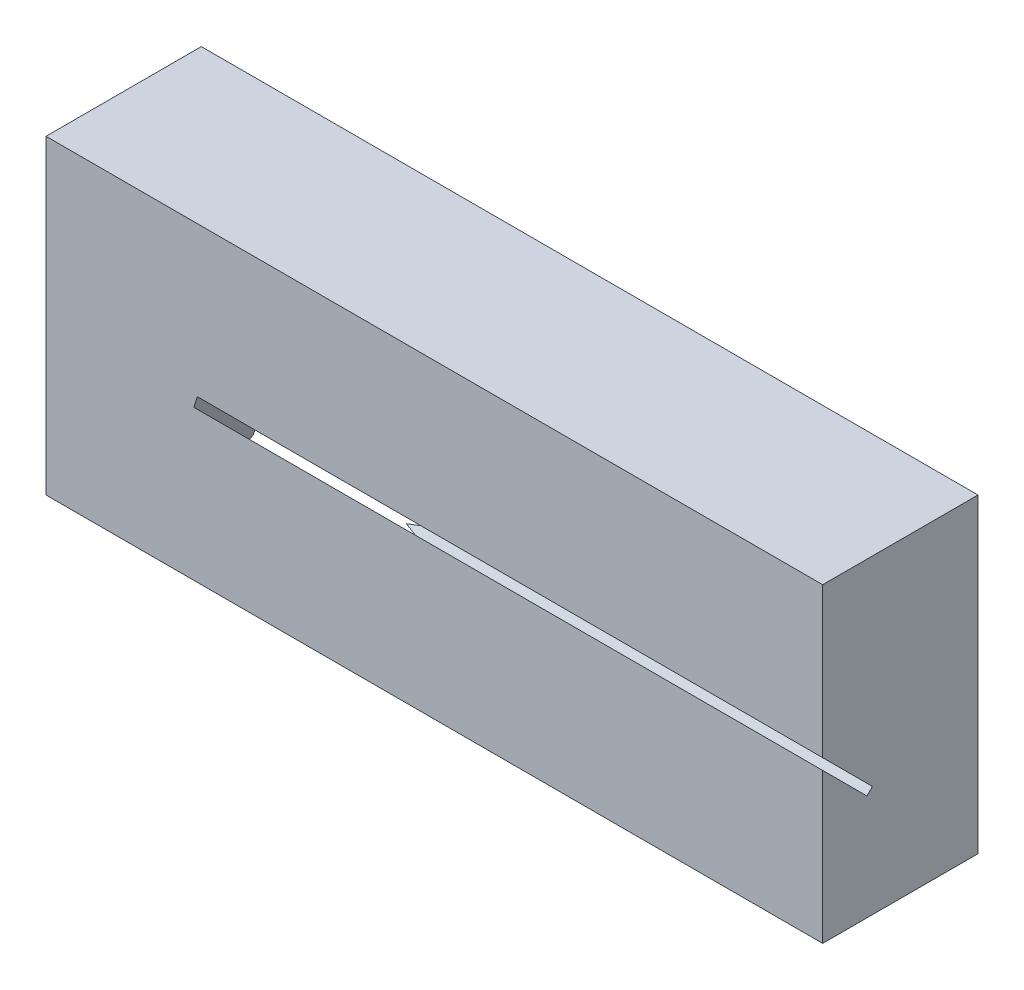
ISO-10303-21;
HEADER;
FILE_DESCRIPTION(('STEP AP214'),'2;1');
FILE_NAME('part.step','',(''),(''),'','','');
FILE_SCHEMA(('AUTOMOTIVE_DESIGN { 1 0 10303 214 1 1 1 1 }'));
ENDSEC;
DATA;
#1=APPLICATION_CONTEXT('core data for automotive mechanical design processes');
#2=APPLICATION_PROTOCOL_DEFINITION('international standard','automotive_design',2000,#1);
#3=PRODUCT_CONTEXT('',#1,'mechanical');
#4=PRODUCT('Part','Part','',(#3));
#5=PRODUCT_RELATED_PRODUCT_CATEGORY('part','',(#4));
#6=PRODUCT_DEFINITION_FORMATION('','',#4);
#7=PRODUCT_DEFINITION_CONTEXT('part definition',#1,'design');
#8=PRODUCT_DEFINITION('design','',#6,#7);
#9=PRODUCT_DEFINITION_SHAPE('','',#8);
#10=(LENGTH_UNIT() NAMED_UNIT(*) SI_UNIT(.MILLI.,.METRE.));
#11=(NAMED_UNIT(*) PLANE_ANGLE_UNIT() SI_UNIT($,.RADIAN.));
#12=(NAMED_UNIT(*) SI_UNIT($,.STERADIAN.) SOLID_ANGLE_UNIT());
#13=UNCERTAINTY_MEASURE_WITH_UNIT(LENGTH_MEASURE(1.E-05),#10,'distance_accuracy_value','');
#14=(GEOMETRIC_REPRESENTATION_CONTEXT(3) GLOBAL_UNCERTAINTY_ASSIGNED_CONTEXT((#13)) GLOBAL_UNIT_ASSIGNED_CONTEXT((#10,
#11,#12)) REPRESENTATION_CONTEXT('',''));
#15=CARTESIAN_POINT('',(0.,0.,0.));
#16=DIRECTION('',(0.,0.,1.));
#17=DIRECTION('',(1.,0.,0.));
#18=AXIS2_PLACEMENT_3D('',#15,#16,#17);
#19=CARTESIAN_POINT('',(25.,10.,10.));
#20=DIRECTION('',(-1.,0.,0.));
#21=DIRECTION('',(0.,-1.,0.));
#22=AXIS2_PLACEMENT_3D('',#19,#20,#21);
#23=PLANE('',#22);
#24=DIRECTION('',(0.,0.707106781186549,0.707106781186546));
#25=VECTOR('',#24,1.);
#26=CARTESIAN_POINT('',(25.,5.17677669529667,14.8232233047033));
#27=LINE('',#26,#25);
#28=CARTESIAN_POINT('',(25.,-2.85004648115068,6.79640012825603));
#29=VERTEX_POINT('',#28);
#30=CARTESIAN_POINT('',(25.,0.353553390593306,10.));
#31=VERTEX_POINT('',#30);
#32=EDGE_CURVE('E110',#29,#31,#27,.T.);
#33=ORIENTED_EDGE('',*,*,#32,.F.);
#34=DIRECTION('',(0.,-0.707106781186546,0.707106781186549));
#35=VECTOR('',#34,1.);
#36=CARTESIAN_POINT('',(25.,1.97317682355265,1.97317682355268));
#37=LINE('',#36,#35);
#38=CARTESIAN_POINT('',(25.,-3.20359987174395,7.1499535188493));
#39=VERTEX_POINT('',#38);
#40=EDGE_CURVE('E133',#29,#39,#37,.T.);
#41=ORIENTED_EDGE('',*,*,#40,.T.);
#42=DIRECTION('',(0.,0.707106781186549,0.707106781186546));
#43=VECTOR('',#42,1.);
#44=CARTESIAN_POINT('',(25.,4.8232233047034,15.1767766952966));
#45=LINE('',#44,#43);
#46=CARTESIAN_POINT('',(25.,-0.353553390593243,10.));
#47=VERTEX_POINT('',#46);
#48=EDGE_CURVE('E126',#39,#47,#45,.T.);
#49=ORIENTED_EDGE('',*,*,#48,.T.);
#50=DIRECTION('',(0.,1.,0.));
#51=VECTOR('',#50,1.);
#52=CARTESIAN_POINT('',(25.,10.,10.));
#53=LINE('',#52,#51);
#54=CARTESIAN_POINT('',(25.,-10.,10.));
#55=VERTEX_POINT('',#54);
#56=EDGE_CURVE('E140',#55,#47,#53,.T.);
#57=ORIENTED_EDGE('',*,*,#56,.F.);
#58=DIRECTION('',(0.,0.,-1.));
#59=VECTOR('',#58,1.);
#60=CARTESIAN_POINT('',(25.,-10.,10.));
#61=LINE('',#60,#59);
#62=CARTESIAN_POINT('',(25.,-10.,0.));
#63=VERTEX_POINT('',#62);
#64=EDGE_CURVE('E149',#55,#63,#61,.T.);
#65=ORIENTED_EDGE('',*,*,#64,.T.);
#66=DIRECTION('',(0.,1.,0.));
#67=VECTOR('',#66,1.);
#68=CARTESIAN_POINT('',(25.,10.,0.));
#69=LINE('',#68,#67);
#70=CARTESIAN_POINT('',(25.,10.,0.));
#71=VERTEX_POINT('',#70);
#72=EDGE_CURVE('E139',#63,#71,#69,.T.);
#73=ORIENTED_EDGE('',*,*,#72,.T.);
#74=DIRECTION('',(0.,0.,-1.));
#75=VECTOR('',#74,1.);
#76=CARTESIAN_POINT('',(25.,10.,10.));
#77=LINE('',#76,#75);
#78=CARTESIAN_POINT('',(25.,10.,10.));
#79=VERTEX_POINT('',#78);
#80=EDGE_CURVE('E168',#79,#71,#77,.T.);
#81=ORIENTED_EDGE('',*,*,#80,.F.);
#82=EDGE_CURVE('E143',#31,#79,#53,.T.);
#83=ORIENTED_EDGE('',*,*,#82,.F.);
#84=EDGE_LOOP('',(#33,#41,#49,#57,#65,#73,#81,#83));
#85=FACE_BOUND('',#84,.T.);
#86=ADVANCED_FACE('F33',(#85),#23,.F.);
#87=CARTESIAN_POINT('',(0.,0.,10.));
#88=DIRECTION('',(0.,0.,1.));
#89=DIRECTION('',(1.,0.,0.));
#90=AXIS2_PLACEMENT_3D('',#87,#88,#89);
#91=PLANE('',#90);
#92=DIRECTION('',(-0.300294039609494,-0.953846680434026,0.));
#93=VECTOR('',#92,1.);
#94=CARTESIAN_POINT('',(-13.9820122594664,4.40187613941699,10.));
#95=LINE('',#94,#93);
#96=CARTESIAN_POINT('',(-15.2565223215386,0.353553390593307,10.));
#97=VERTEX_POINT('',#96);
#98=CARTESIAN_POINT('',(-15.4791366641928,-0.353553390593244,10.));
#99=VERTEX_POINT('',#98);
#100=EDGE_CURVE('E118',#97,#99,#95,.T.);
#101=ORIENTED_EDGE('',*,*,#100,.F.);
#102=DIRECTION('',(1.,0.,0.));
#103=VECTOR('',#102,1.);
#104=CARTESIAN_POINT('',(0.,0.353553390593307,10.));
#105=LINE('',#104,#103);
#106=EDGE_CURVE('E106',#97,#31,#105,.T.);
#107=ORIENTED_EDGE('',*,*,#106,.T.);
#108=ORIENTED_EDGE('',*,*,#82,.T.);
#109=DIRECTION('',(-1.,0.,0.));
#110=VECTOR('',#109,1.);
#111=CARTESIAN_POINT('',(-25.,10.,10.));
#112=LINE('',#111,#110);
#113=CARTESIAN_POINT('',(-25.,10.,10.));
#114=VERTEX_POINT('',#113);
#115=EDGE_CURVE('E142',#79,#114,#112,.T.);
#116=ORIENTED_EDGE('',*,*,#115,.T.);
#117=DIRECTION('',(0.,-1.,0.));
#118=VECTOR('',#117,1.);
#119=CARTESIAN_POINT('',(-25.,10.,10.));
#120=LINE('',#119,#118);
#121=CARTESIAN_POINT('',(-25.,-10.,10.));
#122=VERTEX_POINT('',#121);
#123=EDGE_CURVE('E145',#114,#122,#120,.T.);
#124=ORIENTED_EDGE('',*,*,#123,.T.);
#125=DIRECTION('',(1.,0.,0.));
#126=VECTOR('',#125,1.);
#127=CARTESIAN_POINT('',(-25.,-10.,10.));
#128=LINE('',#127,#126);
#129=EDGE_CURVE('E147',#122,#55,#128,.T.);
#130=ORIENTED_EDGE('',*,*,#129,.T.);
#131=ORIENTED_EDGE('',*,*,#56,.T.);
#132=DIRECTION('',(1.,0.,0.));
#133=VECTOR('',#132,1.);
#134=CARTESIAN_POINT('',(0.,-0.353553390593243,10.));
#135=LINE('',#134,#133);
#136=EDGE_CURVE('E11',#99,#47,#135,.T.);
#137=ORIENTED_EDGE('',*,*,#136,.F.);
#138=EDGE_LOOP('',(#101,#107,#108,#116,#124,#130,#131,#137));
#139=FACE_BOUND('',#138,.T.);
#140=ADVANCED_FACE('F124',(#139),#91,.T.);
#141=CARTESIAN_POINT('',(-25.,10.,10.));
#142=DIRECTION('',(0.,-1.,0.));
#143=DIRECTION('',(0.,0.,-1.));
#144=AXIS2_PLACEMENT_3D('',#141,#142,#143);
#145=PLANE('',#144);
#146=DIRECTION('',(-1.,0.,0.));
#147=VECTOR('',#146,1.);
#148=CARTESIAN_POINT('',(-25.,10.,0.));
#149=LINE('',#148,#147);
#150=CARTESIAN_POINT('',(-25.,10.,0.));
#151=VERTEX_POINT('',#150);
#152=EDGE_CURVE('E152',#71,#151,#149,.T.);
#153=ORIENTED_EDGE('',*,*,#152,.T.);
#154=DIRECTION('',(0.,0.,-1.));
#155=VECTOR('',#154,1.);
#156=CARTESIAN_POINT('',(-25.,10.,10.));
#157=LINE('',#156,#155);
#158=EDGE_CURVE('E165',#114,#151,#157,.T.);
#159=ORIENTED_EDGE('',*,*,#158,.F.);
#160=ORIENTED_EDGE('',*,*,#115,.F.);
#161=ORIENTED_EDGE('',*,*,#80,.T.);
#162=EDGE_LOOP('',(#153,#159,#160,#161));
#163=FACE_BOUND('',#162,.T.);
#164=ADVANCED_FACE('F193',(#163),#145,.F.);
#165=CARTESIAN_POINT('',(-25.,10.,10.));
#166=DIRECTION('',(1.,0.,0.));
#167=DIRECTION('',(0.,1.,0.));
#168=AXIS2_PLACEMENT_3D('',#165,#166,#167);
#169=PLANE('',#168);
#170=DIRECTION('',(0.,-1.,0.));
#171=VECTOR('',#170,1.);
#172=CARTESIAN_POINT('',(-25.,10.,0.));
#173=LINE('',#172,#171);
#174=CARTESIAN_POINT('',(-25.,-10.,0.));
#175=VERTEX_POINT('',#174);
#176=EDGE_CURVE('E154',#151,#175,#173,.T.);
#177=ORIENTED_EDGE('',*,*,#176,.T.);
#178=DIRECTION('',(0.,0.,-1.));
#179=VECTOR('',#178,1.);
#180=CARTESIAN_POINT('',(-25.,-10.,10.));
#181=LINE('',#180,#179);
#182=EDGE_CURVE('E162',#122,#175,#181,.T.);
#183=ORIENTED_EDGE('',*,*,#182,.F.);
#184=ORIENTED_EDGE('',*,*,#123,.F.);
#185=ORIENTED_EDGE('',*,*,#158,.T.);
#186=EDGE_LOOP('',(#177,#183,#184,#185));
#187=FACE_BOUND('',#186,.T.);
#188=ADVANCED_FACE('F186',(#187),#169,.F.);
#189=CARTESIAN_POINT('',(-25.,-10.,10.));
#190=DIRECTION('',(0.,1.,0.));
#191=DIRECTION('',(0.,0.,1.));
#192=AXIS2_PLACEMENT_3D('',#189,#190,#191);
#193=PLANE('',#192);
#194=DIRECTION('',(1.,0.,0.));
#195=VECTOR('',#194,1.);
#196=CARTESIAN_POINT('',(-25.,-10.,0.));
#197=LINE('',#196,#195);
#198=CARTESIAN_POINT('',(-21.6643139440744,-10.,0.));
#199=VERTEX_POINT('',#198);
#200=EDGE_CURVE('E157',#175,#199,#197,.T.);
#201=ORIENTED_EDGE('',*,*,#200,.T.);
#202=DIRECTION('',(0.300294039609493,0.,0.953846680434027));
#203=VECTOR('',#202,1.);
#204=CARTESIAN_POINT('',(-19.1007697434475,-10.,8.14277942077588));
#205=LINE('',#204,#203);
#206=CARTESIAN_POINT('',(-21.5530067727473,-10.,0.353553390593277));
#207=VERTEX_POINT('',#206);
#208=EDGE_CURVE('E127',#199,#207,#205,.T.);
#209=ORIENTED_EDGE('',*,*,#208,.T.);
#210=DIRECTION('',(1.,0.,0.));
#211=VECTOR('',#210,1.);
#212=CARTESIAN_POINT('',(-25.,-10.,0.353553390593278));
#213=LINE('',#212,#211);
#214=CARTESIAN_POINT('',(-10.8708348754012,-10.,0.353553390593278));
#215=VERTEX_POINT('',#214);
#216=EDGE_CURVE('E130',#207,#215,#213,.T.);
#217=ORIENTED_EDGE('',*,*,#216,.T.);
#218=DIRECTION('',(-0.935113126531029,0.,-0.354349320006917));
#219=VECTOR('',#218,1.);
#220=CARTESIAN_POINT('',(-20.0294786941052,-10.,-3.11699912039815));
#221=LINE('',#220,#219);
#222=CARTESIAN_POINT('',(-11.8038475772934,-10.,0.));
#223=VERTEX_POINT('',#222);
#224=EDGE_CURVE('E197',#215,#223,#221,.T.);
#225=ORIENTED_EDGE('',*,*,#224,.T.);
#226=EDGE_CURVE('E156',#223,#63,#197,.T.);
#227=ORIENTED_EDGE('',*,*,#226,.T.);
#228=ORIENTED_EDGE('',*,*,#64,.F.);
#229=ORIENTED_EDGE('',*,*,#129,.F.);
#230=ORIENTED_EDGE('',*,*,#182,.T.);
#231=EDGE_LOOP('',(#201,#209,#217,#225,#227,#228,#229,#230));
#232=FACE_BOUND('',#231,.T.);
#233=ADVANCED_FACE('F180',(#232),#193,.F.);
#234=CARTESIAN_POINT('',(0.,0.,0.));
#235=DIRECTION('',(0.,0.,1.));
#236=DIRECTION('',(1.,0.,0.));
#237=AXIS2_PLACEMENT_3D('',#234,#235,#236);
#238=PLANE('',#237);
#239=DIRECTION('',(1.,0.,0.));
#240=VECTOR('',#239,1.);
#241=CARTESIAN_POINT('',(0.,-9.64644660940673,0.));
#242=LINE('',#241,#240);
#243=CARTESIAN_POINT('',(-21.5530067727473,-9.64644660940673,0.));
#244=VERTEX_POINT('',#243);
#245=CARTESIAN_POINT('',(-10.8708348754012,-9.64644660940673,0.));
#246=VERTEX_POINT('',#245);
#247=EDGE_CURVE('E171',#244,#246,#242,.T.);
#248=ORIENTED_EDGE('',*,*,#247,.F.);
#249=DIRECTION('',(-0.300294039609494,-0.953846680434026,0.));
#250=VECTOR('',#249,1.);
#251=CARTESIAN_POINT('',(-16.8463569878228,5.30364124166687,0.));
#252=LINE('',#251,#250);
#253=EDGE_CURVE('E40',#244,#199,#252,.T.);
#254=ORIENTED_EDGE('',*,*,#253,.T.);
#255=ORIENTED_EDGE('',*,*,#200,.F.);
#256=ORIENTED_EDGE('',*,*,#176,.F.);
#257=ORIENTED_EDGE('',*,*,#152,.F.);
#258=ORIENTED_EDGE('',*,*,#72,.F.);
#259=ORIENTED_EDGE('',*,*,#226,.F.);
#260=DIRECTION('',(0.935113126531029,0.354349320006915,0.));
#261=VECTOR('',#260,1.);
#262=CARTESIAN_POINT('',(1.83143529116073,-4.83308160750287,0.));
#263=LINE('',#262,#261);
#264=EDGE_CURVE('E173',#223,#246,#263,.T.);
#265=ORIENTED_EDGE('',*,*,#264,.T.);
#266=EDGE_LOOP('',(#248,#254,#255,#256,#257,#258,#259,#265));
#267=FACE_BOUND('',#266,.T.);
#268=ADVANCED_FACE('F177',(#267),#238,.F.);
#269=CARTESIAN_POINT('',(0.,-5.17677669529662,5.17677669529664));
#270=DIRECTION('',(0.,-0.707106781186546,0.707106781186549));
#271=DIRECTION('',(0.,-0.707106781186549,-0.707106781186546));
#272=AXIS2_PLACEMENT_3D('',#269,#270,#271);
#273=PLANE('',#272);
#274=DIRECTION('',(-0.406736643075797,-0.645974188021253,-0.645974188021251));
#275=VECTOR('',#274,1.);
#276=CARTESIAN_POINT('',(-23.,-12.2980970388563,-1.944543648263));
#277=LINE('',#276,#275);
#278=EDGE_CURVE('E46',#99,#207,#277,.T.);
#279=ORIENTED_EDGE('',*,*,#278,.F.);
#280=ORIENTED_EDGE('',*,*,#136,.T.);
#281=ORIENTED_EDGE('',*,*,#48,.F.);
#282=DIRECTION('',(0.965925826289068,0.18301270189222,0.18301270189222));
#283=VECTOR('',#282,1.);
#284=CARTESIAN_POINT('',(-23.,-12.2980970388563,-1.944543648263));
#285=LINE('',#284,#283);
#286=EDGE_CURVE('E122',#215,#39,#285,.T.);
#287=ORIENTED_EDGE('',*,*,#286,.F.);
#288=ORIENTED_EDGE('',*,*,#216,.F.);
#289=EDGE_LOOP('',(#279,#280,#281,#287,#288));
#290=FACE_BOUND('',#289,.T.);
#291=ADVANCED_FACE('F209',(#290),#273,.F.);
#292=CARTESIAN_POINT('',(-23.,-11.944543648263,-2.29809703885628));
#293=DIRECTION('',(-0.913545457642602,0.287606238475949,0.287606238475948));
#294=DIRECTION('',(-0.300294039609494,-0.953846680434026,0.));
#295=AXIS2_PLACEMENT_3D('',#292,#293,#294);
#296=PLANE('',#295);
#297=ORIENTED_EDGE('',*,*,#100,.T.);
#298=ORIENTED_EDGE('',*,*,#278,.T.);
#299=ORIENTED_EDGE('',*,*,#208,.F.);
#300=ORIENTED_EDGE('',*,*,#253,.F.);
#301=DIRECTION('',(-0.406736643075797,-0.645974188021253,-0.645974188021251));
#302=VECTOR('',#301,1.);
#303=CARTESIAN_POINT('',(-23.,-11.944543648263,-2.29809703885628));
#304=LINE('',#303,#302);
#305=EDGE_CURVE('E54',#97,#244,#304,.T.);
#306=ORIENTED_EDGE('',*,*,#305,.F.);
#307=EDGE_LOOP('',(#297,#298,#299,#300,#306));
#308=FACE_BOUND('',#307,.T.);
#309=ADVANCED_FACE('F117',(#308),#296,.F.);
#310=CARTESIAN_POINT('',(-23.,-11.944543648263,-2.29809703885628));
#311=DIRECTION('',(0.258819045102522,-0.68301270189222,-0.683012701892218));
#312=DIRECTION('',(0.,0.707106781186546,-0.707106781186549));
#313=AXIS2_PLACEMENT_3D('',#310,#311,#312);
#314=PLANE('',#313);
#315=DIRECTION('',(0.965925826289068,0.18301270189222,0.18301270189222));
#316=VECTOR('',#315,1.);
#317=CARTESIAN_POINT('',(-23.,-11.944543648263,-2.29809703885628));
#318=LINE('',#317,#316);
#319=EDGE_CURVE('E114',#246,#29,#318,.T.);
#320=ORIENTED_EDGE('',*,*,#319,.F.);
#321=ORIENTED_EDGE('',*,*,#264,.F.);
#322=ORIENTED_EDGE('',*,*,#224,.F.);
#323=ORIENTED_EDGE('',*,*,#286,.T.);
#324=ORIENTED_EDGE('',*,*,#40,.F.);
#325=EDGE_LOOP('',(#320,#321,#322,#323,#324));
#326=FACE_BOUND('',#325,.T.);
#327=ADVANCED_FACE('F200',(#326),#314,.F.);
#328=CARTESIAN_POINT('',(0.,-4.82322330470335,4.82322330470336));
#329=DIRECTION('',(0.,-0.707106781186546,0.707106781186549));
#330=DIRECTION('',(0.,-0.707106781186549,-0.707106781186546));
#331=AXIS2_PLACEMENT_3D('',#328,#329,#330);
#332=PLANE('',#331);
#333=ORIENTED_EDGE('',*,*,#32,.T.);
#334=ORIENTED_EDGE('',*,*,#106,.F.);
#335=ORIENTED_EDGE('',*,*,#305,.T.);
#336=ORIENTED_EDGE('',*,*,#247,.T.);
#337=ORIENTED_EDGE('',*,*,#319,.T.);
#338=EDGE_LOOP('',(#333,#334,#335,#336,#337));
#339=FACE_BOUND('',#338,.T.);
#340=ADVANCED_FACE('F107',(#339),#332,.T.);
#341=CLOSED_SHELL('',(#86,#140,#164,#188,#233,#268,#291,#309,#327,#340));
#342=MANIFOLD_SOLID_BREP('B2',#341);
#343=ADVANCED_BREP_SHAPE_REPRESENTATION('',(#18,#342),#14);
#344=SHAPE_DEFINITION_REPRESENTATION(#9,#343);
ENDSEC;
END-ISO-10303-21;
